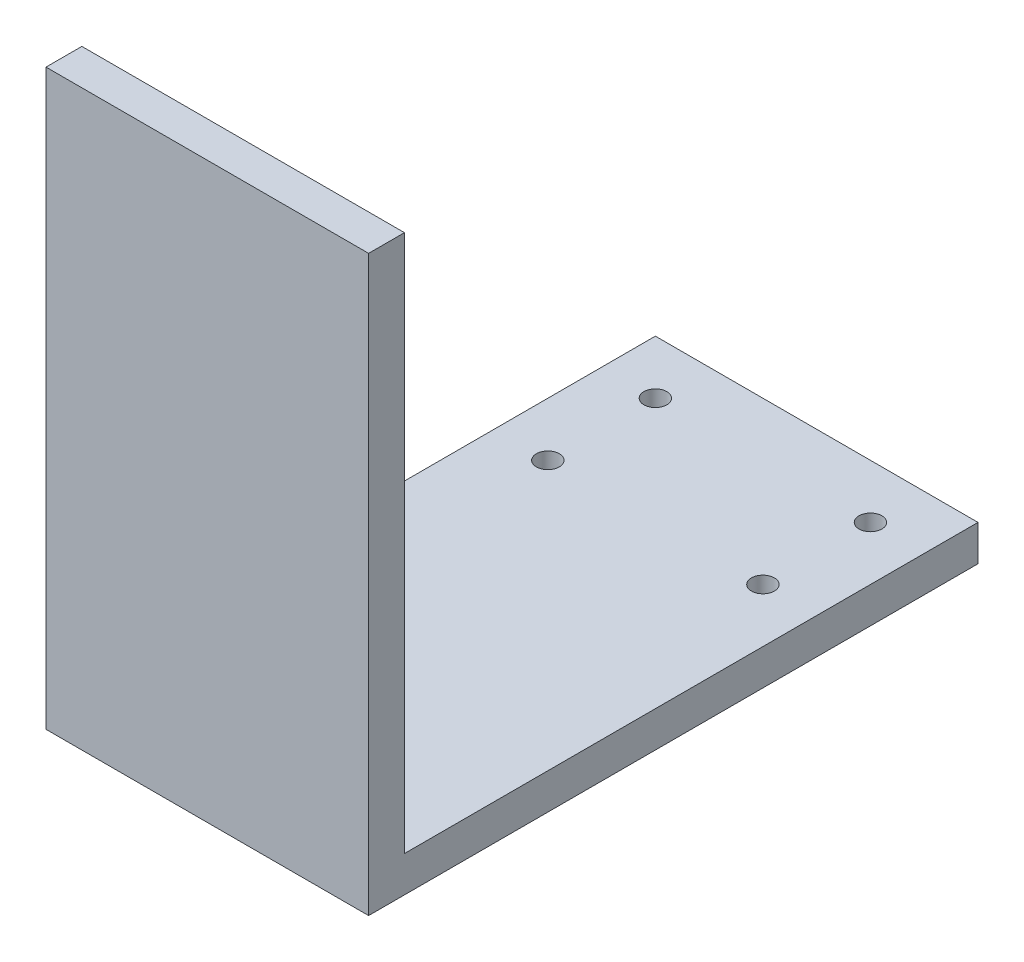
ISO-10303-21;
HEADER;
FILE_DESCRIPTION(('STEP AP214'),'2;1');
FILE_NAME('part.step','',(''),(''),'','','');
FILE_SCHEMA(('AUTOMOTIVE_DESIGN { 1 0 10303 214 1 1 1 1 }'));
ENDSEC;
DATA;
#1=APPLICATION_CONTEXT('core data for automotive mechanical design processes');
#2=APPLICATION_PROTOCOL_DEFINITION('international standard','automotive_design',2000,#1);
#3=PRODUCT_CONTEXT('',#1,'mechanical');
#4=PRODUCT('Part','Part','',(#3));
#5=PRODUCT_RELATED_PRODUCT_CATEGORY('part','',(#4));
#6=PRODUCT_DEFINITION_FORMATION('','',#4);
#7=PRODUCT_DEFINITION_CONTEXT('part definition',#1,'design');
#8=PRODUCT_DEFINITION('design','',#6,#7);
#9=PRODUCT_DEFINITION_SHAPE('','',#8);
#10=(LENGTH_UNIT() NAMED_UNIT(*) SI_UNIT(.MILLI.,.METRE.));
#11=(NAMED_UNIT(*) PLANE_ANGLE_UNIT() SI_UNIT($,.RADIAN.));
#12=(NAMED_UNIT(*) SI_UNIT($,.STERADIAN.) SOLID_ANGLE_UNIT());
#13=UNCERTAINTY_MEASURE_WITH_UNIT(LENGTH_MEASURE(1.E-05),#10,'distance_accuracy_value','');
#14=(GEOMETRIC_REPRESENTATION_CONTEXT(3) GLOBAL_UNCERTAINTY_ASSIGNED_CONTEXT((#13)) GLOBAL_UNIT_ASSIGNED_CONTEXT((#10,
#11,#12)) REPRESENTATION_CONTEXT('',''));
#15=CARTESIAN_POINT('',(0.,0.,0.));
#16=DIRECTION('',(0.,0.,1.));
#17=DIRECTION('',(1.,0.,0.));
#18=AXIS2_PLACEMENT_3D('',#15,#16,#17);
#19=CARTESIAN_POINT('',(0.,5.,0.));
#20=DIRECTION('',(0.,-1.,0.));
#21=DIRECTION('',(0.,0.,-1.));
#22=AXIS2_PLACEMENT_3D('',#19,#20,#21);
#23=PLANE('',#22);
#24=CARTESIAN_POINT('',(-15.,5.,-7.5));
#25=DIRECTION('',(0.,-1.,0.));
#26=DIRECTION('',(0.,0.,-1.));
#27=AXIS2_PLACEMENT_3D('',#24,#25,#26);
#28=CIRCLE('',#27,1.6);
#29=CARTESIAN_POINT('',(-15.,5.,-9.1));
#30=VERTEX_POINT('',#29);
#31=EDGE_CURVE('E96',#30,#30,#28,.T.);
#32=ORIENTED_EDGE('',*,*,#31,.T.);
#33=EDGE_LOOP('',(#32));
#34=FACE_BOUND('',#33,.T.);
#35=CARTESIAN_POINT('',(15.,5.,-7.5));
#36=DIRECTION('',(0.,-1.,0.));
#37=DIRECTION('',(0.,0.,-1.));
#38=AXIS2_PLACEMENT_3D('',#35,#36,#37);
#39=CIRCLE('',#38,1.6);
#40=CARTESIAN_POINT('',(15.,5.,-9.1));
#41=VERTEX_POINT('',#40);
#42=EDGE_CURVE('E115',#41,#41,#39,.T.);
#43=ORIENTED_EDGE('',*,*,#42,.T.);
#44=EDGE_LOOP('',(#43));
#45=FACE_BOUND('',#44,.T.);
#46=CARTESIAN_POINT('',(15.0000000000002,5.,7.5));
#47=DIRECTION('',(0.,-1.,0.));
#48=DIRECTION('',(0.,0.,-1.));
#49=AXIS2_PLACEMENT_3D('',#46,#47,#48);
#50=CIRCLE('',#49,1.6);
#51=CARTESIAN_POINT('',(15.0000000000002,5.,5.9));
#52=VERTEX_POINT('',#51);
#53=EDGE_CURVE('E109',#52,#52,#50,.T.);
#54=ORIENTED_EDGE('',*,*,#53,.T.);
#55=EDGE_LOOP('',(#54));
#56=FACE_BOUND('',#55,.T.);
#57=CARTESIAN_POINT('',(-14.9999999999998,5.,7.5));
#58=DIRECTION('',(0.,-1.,0.));
#59=DIRECTION('',(0.,0.,-1.));
#60=AXIS2_PLACEMENT_3D('',#57,#58,#59);
#61=CIRCLE('',#60,1.6);
#62=CARTESIAN_POINT('',(-14.9999999999998,5.,5.9));
#63=VERTEX_POINT('',#62);
#64=EDGE_CURVE('E102',#63,#63,#61,.T.);
#65=ORIENTED_EDGE('',*,*,#64,.T.);
#66=EDGE_LOOP('',(#65));
#67=FACE_BOUND('',#66,.T.);
#68=DIRECTION('',(-1.,0.,0.));
#69=VECTOR('',#68,1.);
#70=CARTESIAN_POINT('',(22.5,5.,65.));
#71=LINE('',#70,#69);
#72=CARTESIAN_POINT('',(22.5,5.,65.));
#73=VERTEX_POINT('',#72);
#74=CARTESIAN_POINT('',(-22.5,5.,65.));
#75=VERTEX_POINT('',#74);
#76=EDGE_CURVE('E47',#73,#75,#71,.T.);
#77=ORIENTED_EDGE('',*,*,#76,.F.);
#78=DIRECTION('',(0.,0.,-1.));
#79=VECTOR('',#78,1.);
#80=CARTESIAN_POINT('',(22.5,5.,15.));
#81=LINE('',#80,#79);
#82=CARTESIAN_POINT('',(22.5,5.,-15.));
#83=VERTEX_POINT('',#82);
#84=EDGE_CURVE('E88',#73,#83,#81,.T.);
#85=ORIENTED_EDGE('',*,*,#84,.T.);
#86=DIRECTION('',(-1.,0.,0.));
#87=VECTOR('',#86,1.);
#88=CARTESIAN_POINT('',(-22.5,5.,-15.));
#89=LINE('',#88,#87);
#90=CARTESIAN_POINT('',(-22.5,5.,-15.));
#91=VERTEX_POINT('',#90);
#92=EDGE_CURVE('E53',#83,#91,#89,.T.);
#93=ORIENTED_EDGE('',*,*,#92,.T.);
#94=DIRECTION('',(0.,0.,1.));
#95=VECTOR('',#94,1.);
#96=CARTESIAN_POINT('',(-22.5,5.,15.));
#97=LINE('',#96,#95);
#98=EDGE_CURVE('E83',#91,#75,#97,.T.);
#99=ORIENTED_EDGE('',*,*,#98,.T.);
#100=EDGE_LOOP('',(#77,#85,#93,#99));
#101=FACE_BOUND('',#100,.T.);
#102=ADVANCED_FACE('F32',(#34,#45,#56,#67,#101),#23,.F.);
#103=CARTESIAN_POINT('',(22.5,5.,15.));
#104=DIRECTION('',(-1.,0.,0.));
#105=DIRECTION('',(0.,0.,1.));
#106=AXIS2_PLACEMENT_3D('',#103,#104,#105);
#107=PLANE('',#106);
#108=DIRECTION('',(0.,0.,-1.));
#109=VECTOR('',#108,1.);
#110=CARTESIAN_POINT('',(22.5,0.,15.));
#111=LINE('',#110,#109);
#112=CARTESIAN_POINT('',(22.5,0.,70.));
#113=VERTEX_POINT('',#112);
#114=CARTESIAN_POINT('',(22.5,0.,-15.));
#115=VERTEX_POINT('',#114);
#116=EDGE_CURVE('E74',#113,#115,#111,.T.);
#117=ORIENTED_EDGE('',*,*,#116,.T.);
#118=DIRECTION('',(0.,-1.,0.));
#119=VECTOR('',#118,1.);
#120=CARTESIAN_POINT('',(22.5,5.,-15.));
#121=LINE('',#120,#119);
#122=EDGE_CURVE('E11',#83,#115,#121,.T.);
#123=ORIENTED_EDGE('',*,*,#122,.F.);
#124=ORIENTED_EDGE('',*,*,#84,.F.);
#125=DIRECTION('',(0.,-1.,0.));
#126=VECTOR('',#125,1.);
#127=CARTESIAN_POINT('',(22.5,80.,65.));
#128=LINE('',#127,#126);
#129=CARTESIAN_POINT('',(22.5,80.,65.));
#130=VERTEX_POINT('',#129);
#131=EDGE_CURVE('E125',#130,#73,#128,.T.);
#132=ORIENTED_EDGE('',*,*,#131,.F.);
#133=DIRECTION('',(0.,0.,-1.));
#134=VECTOR('',#133,1.);
#135=CARTESIAN_POINT('',(22.5,80.,70.));
#136=LINE('',#135,#134);
#137=CARTESIAN_POINT('',(22.5,80.,70.));
#138=VERTEX_POINT('',#137);
#139=EDGE_CURVE('E132',#138,#130,#136,.T.);
#140=ORIENTED_EDGE('',*,*,#139,.F.);
#141=DIRECTION('',(0.,1.,0.));
#142=VECTOR('',#141,1.);
#143=CARTESIAN_POINT('',(22.5,5.,70.));
#144=LINE('',#143,#142);
#145=EDGE_CURVE('E106',#113,#138,#144,.T.);
#146=ORIENTED_EDGE('',*,*,#145,.F.);
#147=EDGE_LOOP('',(#117,#123,#124,#132,#140,#146));
#148=FACE_BOUND('',#147,.T.);
#149=ADVANCED_FACE('F34',(#148),#107,.F.);
#150=CARTESIAN_POINT('',(-22.5,5.,-15.));
#151=DIRECTION('',(0.,0.,1.));
#152=DIRECTION('',(1.,0.,0.));
#153=AXIS2_PLACEMENT_3D('',#150,#151,#152);
#154=PLANE('',#153);
#155=DIRECTION('',(-1.,0.,0.));
#156=VECTOR('',#155,1.);
#157=CARTESIAN_POINT('',(-22.5,0.,-15.));
#158=LINE('',#157,#156);
#159=CARTESIAN_POINT('',(-22.5,0.,-15.));
#160=VERTEX_POINT('',#159);
#161=EDGE_CURVE('E64',#115,#160,#158,.T.);
#162=ORIENTED_EDGE('',*,*,#161,.T.);
#163=DIRECTION('',(0.,-1.,0.));
#164=VECTOR('',#163,1.);
#165=CARTESIAN_POINT('',(-22.5,5.,-15.));
#166=LINE('',#165,#164);
#167=EDGE_CURVE('E40',#91,#160,#166,.T.);
#168=ORIENTED_EDGE('',*,*,#167,.F.);
#169=ORIENTED_EDGE('',*,*,#92,.F.);
#170=ORIENTED_EDGE('',*,*,#122,.T.);
#171=EDGE_LOOP('',(#162,#168,#169,#170));
#172=FACE_BOUND('',#171,.T.);
#173=ADVANCED_FACE('F66',(#172),#154,.F.);
#174=CARTESIAN_POINT('',(-22.5,5.,15.));
#175=DIRECTION('',(1.,0.,0.));
#176=DIRECTION('',(0.,0.,-1.));
#177=AXIS2_PLACEMENT_3D('',#174,#175,#176);
#178=PLANE('',#177);
#179=DIRECTION('',(0.,0.,1.));
#180=VECTOR('',#179,1.);
#181=CARTESIAN_POINT('',(-22.5,0.,15.));
#182=LINE('',#181,#180);
#183=CARTESIAN_POINT('',(-22.5,0.,70.));
#184=VERTEX_POINT('',#183);
#185=EDGE_CURVE('E73',#160,#184,#182,.T.);
#186=ORIENTED_EDGE('',*,*,#185,.T.);
#187=DIRECTION('',(0.,-1.,0.));
#188=VECTOR('',#187,1.);
#189=CARTESIAN_POINT('',(-22.5,5.,70.));
#190=LINE('',#189,#188);
#191=CARTESIAN_POINT('',(-22.5,80.,70.));
#192=VERTEX_POINT('',#191);
#193=EDGE_CURVE('E123',#192,#184,#190,.T.);
#194=ORIENTED_EDGE('',*,*,#193,.F.);
#195=DIRECTION('',(0.,0.,1.));
#196=VECTOR('',#195,1.);
#197=CARTESIAN_POINT('',(-22.5,80.,70.));
#198=LINE('',#197,#196);
#199=CARTESIAN_POINT('',(-22.5,80.,65.));
#200=VERTEX_POINT('',#199);
#201=EDGE_CURVE('E135',#200,#192,#198,.T.);
#202=ORIENTED_EDGE('',*,*,#201,.F.);
#203=DIRECTION('',(0.,-1.,0.));
#204=VECTOR('',#203,1.);
#205=CARTESIAN_POINT('',(-22.5,80.,65.));
#206=LINE('',#205,#204);
#207=EDGE_CURVE('E128',#200,#75,#206,.T.);
#208=ORIENTED_EDGE('',*,*,#207,.T.);
#209=ORIENTED_EDGE('',*,*,#98,.F.);
#210=ORIENTED_EDGE('',*,*,#167,.T.);
#211=EDGE_LOOP('',(#186,#194,#202,#208,#209,#210));
#212=FACE_BOUND('',#211,.T.);
#213=ADVANCED_FACE('F78',(#212),#178,.F.);
#214=CARTESIAN_POINT('',(0.,0.,0.));
#215=DIRECTION('',(0.,-1.,0.));
#216=DIRECTION('',(0.,0.,-1.));
#217=AXIS2_PLACEMENT_3D('',#214,#215,#216);
#218=PLANE('',#217);
#219=CARTESIAN_POINT('',(-14.9999999999998,0.,7.5));
#220=DIRECTION('',(0.,1.,0.));
#221=DIRECTION('',(0.,0.,1.));
#222=AXIS2_PLACEMENT_3D('',#219,#220,#221);
#223=CIRCLE('',#222,1.6);
#224=CARTESIAN_POINT('',(-14.9999999999998,0.,9.1));
#225=VERTEX_POINT('',#224);
#226=EDGE_CURVE('E105',#225,#225,#223,.T.);
#227=ORIENTED_EDGE('',*,*,#226,.T.);
#228=EDGE_LOOP('',(#227));
#229=FACE_BOUND('',#228,.T.);
#230=CARTESIAN_POINT('',(15.0000000000002,0.,7.5));
#231=DIRECTION('',(0.,1.,0.));
#232=DIRECTION('',(0.,0.,1.));
#233=AXIS2_PLACEMENT_3D('',#230,#231,#232);
#234=CIRCLE('',#233,1.6);
#235=CARTESIAN_POINT('',(15.0000000000002,0.,9.1));
#236=VERTEX_POINT('',#235);
#237=EDGE_CURVE('E112',#236,#236,#234,.T.);
#238=ORIENTED_EDGE('',*,*,#237,.T.);
#239=EDGE_LOOP('',(#238));
#240=FACE_BOUND('',#239,.T.);
#241=CARTESIAN_POINT('',(15.,0.,-7.5));
#242=DIRECTION('',(0.,1.,0.));
#243=DIRECTION('',(0.,0.,1.));
#244=AXIS2_PLACEMENT_3D('',#241,#242,#243);
#245=CIRCLE('',#244,1.6);
#246=CARTESIAN_POINT('',(15.,0.,-5.9));
#247=VERTEX_POINT('',#246);
#248=EDGE_CURVE('E99',#247,#247,#245,.T.);
#249=ORIENTED_EDGE('',*,*,#248,.T.);
#250=EDGE_LOOP('',(#249));
#251=FACE_BOUND('',#250,.T.);
#252=CARTESIAN_POINT('',(-15.,0.,-7.5));
#253=DIRECTION('',(0.,1.,0.));
#254=DIRECTION('',(0.,0.,1.));
#255=AXIS2_PLACEMENT_3D('',#252,#253,#254);
#256=CIRCLE('',#255,1.6);
#257=CARTESIAN_POINT('',(-15.,0.,-5.9));
#258=VERTEX_POINT('',#257);
#259=EDGE_CURVE('E93',#258,#258,#256,.T.);
#260=ORIENTED_EDGE('',*,*,#259,.T.);
#261=EDGE_LOOP('',(#260));
#262=FACE_BOUND('',#261,.T.);
#263=ORIENTED_EDGE('',*,*,#116,.F.);
#264=DIRECTION('',(1.,0.,0.));
#265=VECTOR('',#264,1.);
#266=CARTESIAN_POINT('',(-22.5,0.,70.));
#267=LINE('',#266,#265);
#268=EDGE_CURVE('E86',#184,#113,#267,.T.);
#269=ORIENTED_EDGE('',*,*,#268,.F.);
#270=ORIENTED_EDGE('',*,*,#185,.F.);
#271=ORIENTED_EDGE('',*,*,#161,.F.);
#272=EDGE_LOOP('',(#263,#269,#270,#271));
#273=FACE_BOUND('',#272,.T.);
#274=ADVANCED_FACE('F84',(#229,#240,#251,#262,#273),#218,.T.);
#275=CARTESIAN_POINT('',(-15.,5.001,-7.5));
#276=DIRECTION('',(0.,-1.,0.));
#277=DIRECTION('',(0.,0.,-1.));
#278=AXIS2_PLACEMENT_3D('',#275,#276,#277);
#279=CYLINDRICAL_SURFACE('',#278,1.6);
#280=ORIENTED_EDGE('',*,*,#259,.F.);
#281=EDGE_LOOP('',(#280));
#282=FACE_BOUND('',#281,.T.);
#283=ORIENTED_EDGE('',*,*,#31,.F.);
#284=EDGE_LOOP('',(#283));
#285=FACE_BOUND('',#284,.T.);
#286=ADVANCED_FACE('F177',(#282,#285),#279,.F.);
#287=CARTESIAN_POINT('',(15.,5.001,-7.5));
#288=DIRECTION('',(0.,-1.,0.));
#289=DIRECTION('',(0.,0.,-1.));
#290=AXIS2_PLACEMENT_3D('',#287,#288,#289);
#291=CYLINDRICAL_SURFACE('',#290,1.6);
#292=ORIENTED_EDGE('',*,*,#248,.F.);
#293=EDGE_LOOP('',(#292));
#294=FACE_BOUND('',#293,.T.);
#295=ORIENTED_EDGE('',*,*,#42,.F.);
#296=EDGE_LOOP('',(#295));
#297=FACE_BOUND('',#296,.T.);
#298=ADVANCED_FACE('F192',(#294,#297),#291,.F.);
#299=CARTESIAN_POINT('',(15.0000000000002,5.001,7.5));
#300=DIRECTION('',(0.,-1.,0.));
#301=DIRECTION('',(0.,0.,-1.));
#302=AXIS2_PLACEMENT_3D('',#299,#300,#301);
#303=CYLINDRICAL_SURFACE('',#302,1.6);
#304=ORIENTED_EDGE('',*,*,#237,.F.);
#305=EDGE_LOOP('',(#304));
#306=FACE_BOUND('',#305,.T.);
#307=ORIENTED_EDGE('',*,*,#53,.F.);
#308=EDGE_LOOP('',(#307));
#309=FACE_BOUND('',#308,.T.);
#310=ADVANCED_FACE('F199',(#306,#309),#303,.F.);
#311=CARTESIAN_POINT('',(-14.9999999999998,5.001,7.5));
#312=DIRECTION('',(0.,-1.,0.));
#313=DIRECTION('',(0.,0.,-1.));
#314=AXIS2_PLACEMENT_3D('',#311,#312,#313);
#315=CYLINDRICAL_SURFACE('',#314,1.6);
#316=ORIENTED_EDGE('',*,*,#226,.F.);
#317=EDGE_LOOP('',(#316));
#318=FACE_BOUND('',#317,.T.);
#319=ORIENTED_EDGE('',*,*,#64,.F.);
#320=EDGE_LOOP('',(#319));
#321=FACE_BOUND('',#320,.T.);
#322=ADVANCED_FACE('F206',(#318,#321),#315,.F.);
#323=CARTESIAN_POINT('',(0.,0.,70.));
#324=DIRECTION('',(0.,0.,1.));
#325=DIRECTION('',(1.,0.,0.));
#326=AXIS2_PLACEMENT_3D('',#323,#324,#325);
#327=PLANE('',#326);
#328=ORIENTED_EDGE('',*,*,#193,.T.);
#329=ORIENTED_EDGE('',*,*,#268,.T.);
#330=ORIENTED_EDGE('',*,*,#145,.T.);
#331=DIRECTION('',(1.,0.,0.));
#332=VECTOR('',#331,1.);
#333=CARTESIAN_POINT('',(22.5,80.,70.));
#334=LINE('',#333,#332);
#335=EDGE_CURVE('E130',#192,#138,#334,.T.);
#336=ORIENTED_EDGE('',*,*,#335,.F.);
#337=EDGE_LOOP('',(#328,#329,#330,#336));
#338=FACE_BOUND('',#337,.T.);
#339=ADVANCED_FACE('F163',(#338),#327,.T.);
#340=CARTESIAN_POINT('',(22.5,80.,65.));
#341=DIRECTION('',(0.,0.,1.));
#342=DIRECTION('',(1.,0.,0.));
#343=AXIS2_PLACEMENT_3D('',#340,#341,#342);
#344=PLANE('',#343);
#345=ORIENTED_EDGE('',*,*,#76,.T.);
#346=ORIENTED_EDGE('',*,*,#207,.F.);
#347=DIRECTION('',(-1.,0.,0.));
#348=VECTOR('',#347,1.);
#349=CARTESIAN_POINT('',(22.5,80.,65.));
#350=LINE('',#349,#348);
#351=EDGE_CURVE('E138',#130,#200,#350,.T.);
#352=ORIENTED_EDGE('',*,*,#351,.F.);
#353=ORIENTED_EDGE('',*,*,#131,.T.);
#354=EDGE_LOOP('',(#345,#346,#352,#353));
#355=FACE_BOUND('',#354,.T.);
#356=ADVANCED_FACE('F157',(#355),#344,.F.);
#357=CARTESIAN_POINT('',(0.,80.,0.));
#358=DIRECTION('',(0.,1.,0.));
#359=DIRECTION('',(0.,0.,1.));
#360=AXIS2_PLACEMENT_3D('',#357,#358,#359);
#361=PLANE('',#360);
#362=ORIENTED_EDGE('',*,*,#139,.T.);
#363=ORIENTED_EDGE('',*,*,#351,.T.);
#364=ORIENTED_EDGE('',*,*,#201,.T.);
#365=ORIENTED_EDGE('',*,*,#335,.T.);
#366=EDGE_LOOP('',(#362,#363,#364,#365));
#367=FACE_BOUND('',#366,.T.);
#368=ADVANCED_FACE('F146',(#367),#361,.T.);
#369=CLOSED_SHELL('',(#102,#149,#173,#213,#274,#286,#298,#310,#322,#339,#356,#368));
#370=MANIFOLD_SOLID_BREP('B2',#369);
#371=ADVANCED_BREP_SHAPE_REPRESENTATION('',(#18,#370),#14);
#372=SHAPE_DEFINITION_REPRESENTATION(#9,#371);
ENDSEC;
END-ISO-10303-21;
